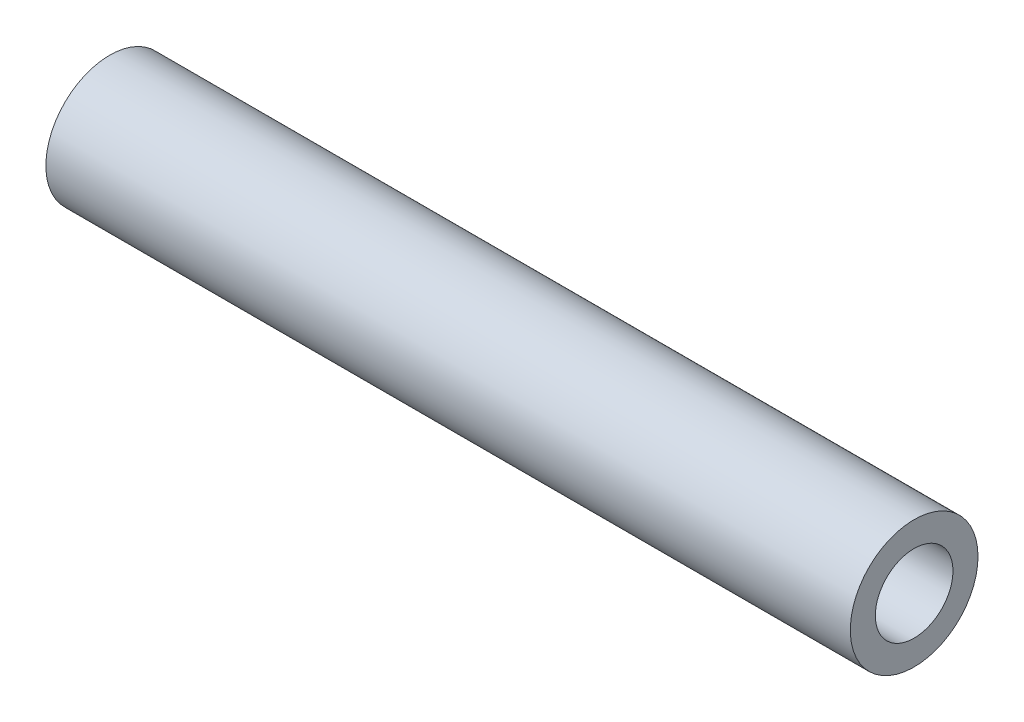
ISO-10303-21;
HEADER;
FILE_DESCRIPTION(('STEP AP214'),'2;1');
FILE_NAME('part.step','',(''),(''),'','','');
FILE_SCHEMA(('AUTOMOTIVE_DESIGN { 1 0 10303 214 1 1 1 1 }'));
ENDSEC;
DATA;
#1=APPLICATION_CONTEXT('core data for automotive mechanical design processes');
#2=APPLICATION_PROTOCOL_DEFINITION('international standard','automotive_design',2000,#1);
#3=PRODUCT_CONTEXT('',#1,'mechanical');
#4=PRODUCT('Part','Part','',(#3));
#5=PRODUCT_RELATED_PRODUCT_CATEGORY('part','',(#4));
#6=PRODUCT_DEFINITION_FORMATION('','',#4);
#7=PRODUCT_DEFINITION_CONTEXT('part definition',#1,'design');
#8=PRODUCT_DEFINITION('design','',#6,#7);
#9=PRODUCT_DEFINITION_SHAPE('','',#8);
#10=(LENGTH_UNIT() NAMED_UNIT(*) SI_UNIT(.MILLI.,.METRE.));
#11=(NAMED_UNIT(*) PLANE_ANGLE_UNIT() SI_UNIT($,.RADIAN.));
#12=(NAMED_UNIT(*) SI_UNIT($,.STERADIAN.) SOLID_ANGLE_UNIT());
#13=UNCERTAINTY_MEASURE_WITH_UNIT(LENGTH_MEASURE(1.E-05),#10,'distance_accuracy_value','');
#14=(GEOMETRIC_REPRESENTATION_CONTEXT(3) GLOBAL_UNCERTAINTY_ASSIGNED_CONTEXT((#13)) GLOBAL_UNIT_ASSIGNED_CONTEXT((#10,
#11,#12)) REPRESENTATION_CONTEXT('',''));
#15=CARTESIAN_POINT('',(0.,0.,0.));
#16=DIRECTION('',(0.,0.,1.));
#17=DIRECTION('',(1.,0.,0.));
#18=AXIS2_PLACEMENT_3D('',#15,#16,#17);
#19=CARTESIAN_POINT('',(20.,0.,0.));
#20=DIRECTION('',(1.,0.,0.));
#21=DIRECTION('',(0.,0.,-1.));
#22=AXIS2_PLACEMENT_3D('',#19,#20,#21);
#23=PLANE('',#22);
#24=CARTESIAN_POINT('',(20.,0.,0.));
#25=DIRECTION('',(1.,0.,0.));
#26=DIRECTION('',(0.,0.,-1.));
#27=AXIS2_PLACEMENT_3D('',#24,#25,#26);
#28=CIRCLE('',#27,3.175);
#29=CARTESIAN_POINT('',(20.,0.,-3.175));
#30=VERTEX_POINT('',#29);
#31=EDGE_CURVE('E10',#30,#30,#28,.T.);
#32=ORIENTED_EDGE('',*,*,#31,.T.);
#33=EDGE_LOOP('',(#32));
#34=FACE_BOUND('',#33,.T.);
#35=CARTESIAN_POINT('',(20.,0.,0.));
#36=DIRECTION('',(1.,0.,0.));
#37=DIRECTION('',(0.,0.,-1.));
#38=AXIS2_PLACEMENT_3D('',#35,#36,#37);
#39=CIRCLE('',#38,1.9304);
#40=CARTESIAN_POINT('',(20.,0.,-1.9304));
#41=VERTEX_POINT('',#40);
#42=EDGE_CURVE('E57',#41,#41,#39,.T.);
#43=ORIENTED_EDGE('',*,*,#42,.F.);
#44=EDGE_LOOP('',(#43));
#45=FACE_BOUND('',#44,.T.);
#46=ADVANCED_FACE('F43',(#34,#45),#23,.T.);
#47=CARTESIAN_POINT('',(-20.,0.,0.));
#48=DIRECTION('',(1.,0.,0.));
#49=DIRECTION('',(0.,0.,-1.));
#50=AXIS2_PLACEMENT_3D('',#47,#48,#49);
#51=PLANE('',#50);
#52=CARTESIAN_POINT('',(-20.,0.,0.));
#53=DIRECTION('',(1.,0.,0.));
#54=DIRECTION('',(0.,0.,-1.));
#55=AXIS2_PLACEMENT_3D('',#52,#53,#54);
#56=CIRCLE('',#55,3.175);
#57=CARTESIAN_POINT('',(-20.,0.,-3.175));
#58=VERTEX_POINT('',#57);
#59=EDGE_CURVE('E47',#58,#58,#56,.T.);
#60=ORIENTED_EDGE('',*,*,#59,.F.);
#61=EDGE_LOOP('',(#60));
#62=FACE_BOUND('',#61,.T.);
#63=CARTESIAN_POINT('',(-20.,0.,0.));
#64=DIRECTION('',(1.,0.,0.));
#65=DIRECTION('',(0.,0.,-1.));
#66=AXIS2_PLACEMENT_3D('',#63,#64,#65);
#67=CIRCLE('',#66,1.9304);
#68=CARTESIAN_POINT('',(-20.,0.,-1.9304));
#69=VERTEX_POINT('',#68);
#70=EDGE_CURVE('E59',#69,#69,#67,.T.);
#71=ORIENTED_EDGE('',*,*,#70,.T.);
#72=EDGE_LOOP('',(#71));
#73=FACE_BOUND('',#72,.T.);
#74=ADVANCED_FACE('F70',(#62,#73),#51,.F.);
#75=CARTESIAN_POINT('',(20.,0.,0.));
#76=DIRECTION('',(-1.,0.,0.));
#77=DIRECTION('',(0.,0.,1.));
#78=AXIS2_PLACEMENT_3D('',#75,#76,#77);
#79=CYLINDRICAL_SURFACE('',#78,3.175);
#80=ORIENTED_EDGE('',*,*,#31,.F.);
#81=EDGE_LOOP('',(#80));
#82=FACE_BOUND('',#81,.T.);
#83=ORIENTED_EDGE('',*,*,#59,.T.);
#84=EDGE_LOOP('',(#83));
#85=FACE_BOUND('',#84,.T.);
#86=ADVANCED_FACE('F45',(#82,#85),#79,.T.);
#87=CARTESIAN_POINT('',(20.,0.,0.));
#88=DIRECTION('',(-1.,0.,0.));
#89=DIRECTION('',(0.,0.,1.));
#90=AXIS2_PLACEMENT_3D('',#87,#88,#89);
#91=CYLINDRICAL_SURFACE('',#90,1.9304);
#92=ORIENTED_EDGE('',*,*,#42,.T.);
#93=EDGE_LOOP('',(#92));
#94=FACE_BOUND('',#93,.T.);
#95=ORIENTED_EDGE('',*,*,#70,.F.);
#96=EDGE_LOOP('',(#95));
#97=FACE_BOUND('',#96,.T.);
#98=ADVANCED_FACE('F66',(#94,#97),#91,.F.);
#99=CLOSED_SHELL('',(#46,#74,#86,#98));
#100=MANIFOLD_SOLID_BREP('B2',#99);
#101=ADVANCED_BREP_SHAPE_REPRESENTATION('',(#18,#100),#14);
#102=SHAPE_DEFINITION_REPRESENTATION(#9,#101);
ENDSEC;
END-ISO-10303-21;
